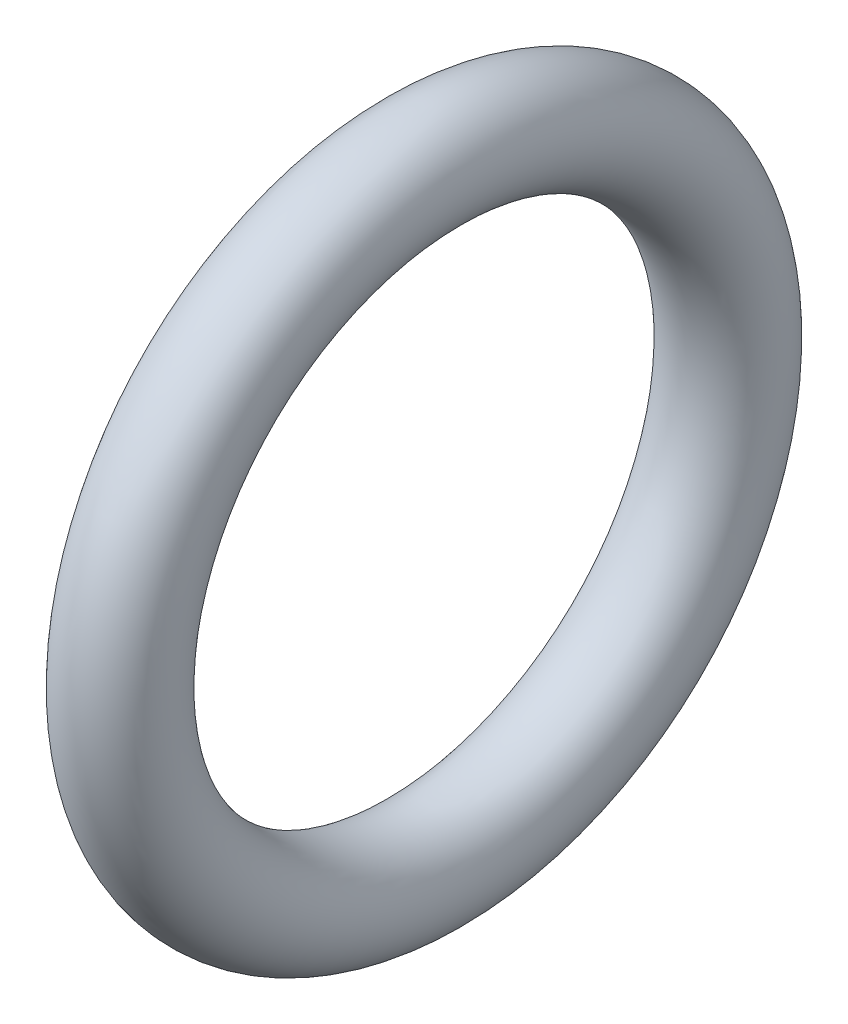
ISO-10303-21;
HEADER;
FILE_DESCRIPTION(('STEP AP214'),'2;1');
FILE_NAME('part.step','',(''),(''),'','','');
FILE_SCHEMA(('AUTOMOTIVE_DESIGN { 1 0 10303 214 1 1 1 1 }'));
ENDSEC;
DATA;
#1=APPLICATION_CONTEXT('core data for automotive mechanical design processes');
#2=APPLICATION_PROTOCOL_DEFINITION('international standard','automotive_design',2000,#1);
#3=PRODUCT_CONTEXT('',#1,'mechanical');
#4=PRODUCT('Part','Part','',(#3));
#5=PRODUCT_RELATED_PRODUCT_CATEGORY('part','',(#4));
#6=PRODUCT_DEFINITION_FORMATION('','',#4);
#7=PRODUCT_DEFINITION_CONTEXT('part definition',#1,'design');
#8=PRODUCT_DEFINITION('design','',#6,#7);
#9=PRODUCT_DEFINITION_SHAPE('','',#8);
#10=(LENGTH_UNIT() NAMED_UNIT(*) SI_UNIT(.MILLI.,.METRE.));
#11=(NAMED_UNIT(*) PLANE_ANGLE_UNIT() SI_UNIT($,.RADIAN.));
#12=(NAMED_UNIT(*) SI_UNIT($,.STERADIAN.) SOLID_ANGLE_UNIT());
#13=UNCERTAINTY_MEASURE_WITH_UNIT(LENGTH_MEASURE(1.E-05),#10,'distance_accuracy_value','');
#14=(GEOMETRIC_REPRESENTATION_CONTEXT(3) GLOBAL_UNCERTAINTY_ASSIGNED_CONTEXT((#13)) GLOBAL_UNIT_ASSIGNED_CONTEXT((#10,
#11,#12)) REPRESENTATION_CONTEXT('',''));
#15=CARTESIAN_POINT('',(0.,0.,0.));
#16=DIRECTION('',(0.,0.,1.));
#17=DIRECTION('',(1.,0.,0.));
#18=AXIS2_PLACEMENT_3D('',#15,#16,#17);
#19=CARTESIAN_POINT('',(11.,0.,0.));
#20=DIRECTION('',(1.,0.,0.));
#21=DIRECTION('',(0.,-1.,0.));
#22=AXIS2_PLACEMENT_3D('',#19,#20,#21);
#23=TOROIDAL_SURFACE('',#22,32.,5.5);
#24=CARTESIAN_POINT('',(11.,-37.5,0.));
#25=VERTEX_POINT('',#24);
#26=VERTEX_LOOP('',#25);
#27=FACE_BOUND('',#26,.T.);
#28=ADVANCED_FACE('F12',(#27),#23,.T.);
#29=CLOSED_SHELL('',(#28));
#30=MANIFOLD_SOLID_BREP('B1',#29);
#31=ADVANCED_BREP_SHAPE_REPRESENTATION('',(#18,#30),#14);
#32=SHAPE_DEFINITION_REPRESENTATION(#9,#31);
ENDSEC;
END-ISO-10303-21;
